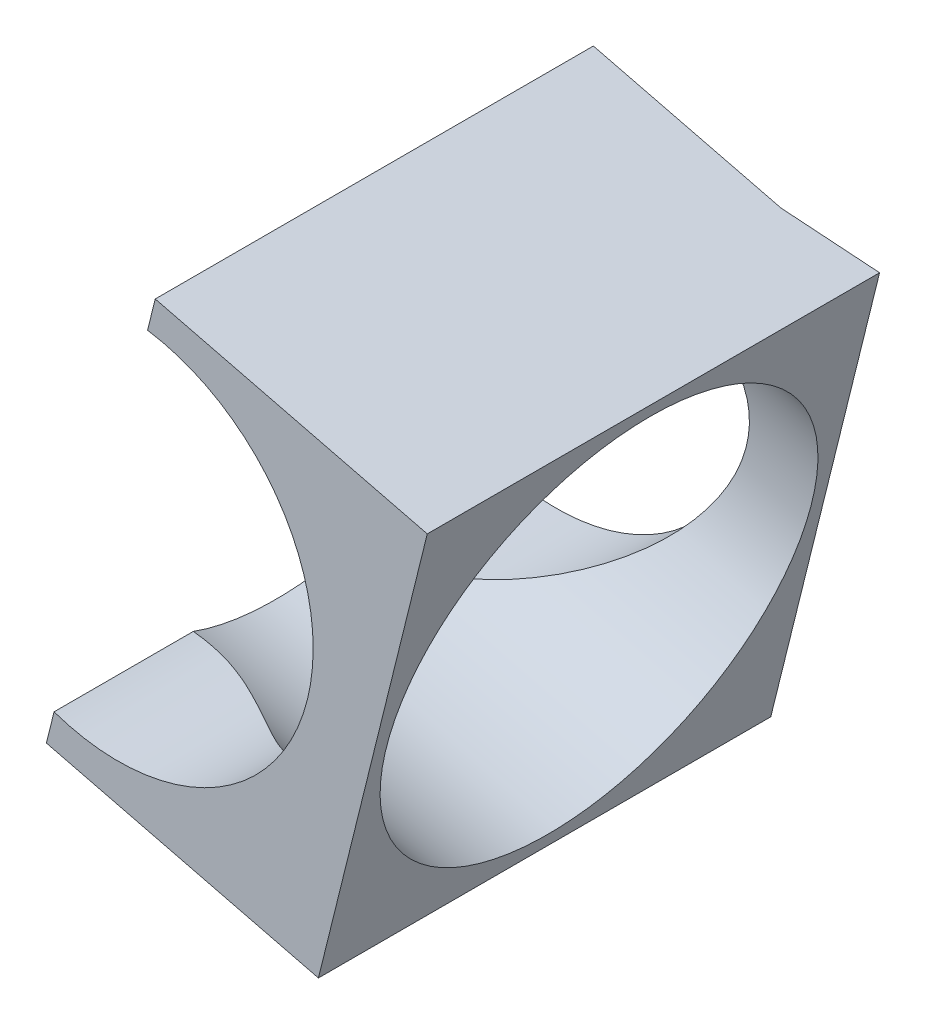
ISO-10303-21;
HEADER;
FILE_DESCRIPTION(('STEP AP214'),'2;1');
FILE_NAME('part.step','',(''),(''),'','','');
FILE_SCHEMA(('AUTOMOTIVE_DESIGN { 1 0 10303 214 1 1 1 1 }'));
ENDSEC;
DATA;
#1=APPLICATION_CONTEXT('core data for automotive mechanical design processes');
#2=APPLICATION_PROTOCOL_DEFINITION('international standard','automotive_design',2000,#1);
#3=PRODUCT_CONTEXT('',#1,'mechanical');
#4=PRODUCT('Part','Part','',(#3));
#5=PRODUCT_RELATED_PRODUCT_CATEGORY('part','',(#4));
#6=PRODUCT_DEFINITION_FORMATION('','',#4);
#7=PRODUCT_DEFINITION_CONTEXT('part definition',#1,'design');
#8=PRODUCT_DEFINITION('design','',#6,#7);
#9=PRODUCT_DEFINITION_SHAPE('','',#8);
#10=(LENGTH_UNIT() NAMED_UNIT(*) SI_UNIT(.MILLI.,.METRE.));
#11=(NAMED_UNIT(*) PLANE_ANGLE_UNIT() SI_UNIT($,.RADIAN.));
#12=(NAMED_UNIT(*) SI_UNIT($,.STERADIAN.) SOLID_ANGLE_UNIT());
#13=UNCERTAINTY_MEASURE_WITH_UNIT(LENGTH_MEASURE(1.E-05),#10,'distance_accuracy_value','');
#14=(GEOMETRIC_REPRESENTATION_CONTEXT(3) GLOBAL_UNCERTAINTY_ASSIGNED_CONTEXT((#13)) GLOBAL_UNIT_ASSIGNED_CONTEXT((#10,
#11,#12)) REPRESENTATION_CONTEXT('',''));
#15=CARTESIAN_POINT('',(0.,0.,0.));
#16=DIRECTION('',(0.,0.,1.));
#17=DIRECTION('',(1.,0.,0.));
#18=AXIS2_PLACEMENT_3D('',#15,#16,#17);
#19=CARTESIAN_POINT('',(0.,5.00000000000001,-61.2251126961954));
#20=DIRECTION('',(0.,0.,1.));
#21=DIRECTION('',(1.,0.,0.));
#22=AXIS2_PLACEMENT_3D('',#19,#20,#21);
#23=CYLINDRICAL_SURFACE('',#22,10.9999999999998);
#24=CARTESIAN_POINT('',(1.66526954813368,15.8732183520821,-17.6489794855667));
#25=CARTESIAN_POINT('',(1.79263034507844,15.8537329498391,-17.6227084909228));
#26=CARTESIAN_POINT('',(1.92065104835838,15.831816404451,-17.6011732618816));
#27=CARTESIAN_POINT('',(2.17708417707887,15.7831914838392,-17.5682368238232));
#28=CARTESIAN_POINT('',(2.30549662123175,15.7564828760743,-17.5568361067563));
#29=CARTESIAN_POINT('',(2.56016393760055,15.6987111197839,-17.5449091993817));
#30=CARTESIAN_POINT('',(2.68642565768366,15.6677068480607,-17.5442482859071));
#31=CARTESIAN_POINT('',(2.93737807330728,15.6013512316323,-17.5534656665461));
#32=CARTESIAN_POINT('',(3.06206905517549,15.5660006922239,-17.5633420108636));
#33=CARTESIAN_POINT('',(3.30907726053065,15.4912663344357,-17.5931538763105));
#34=CARTESIAN_POINT('',(3.43139314938191,15.4518803222101,-17.6130948923757));
#35=CARTESIAN_POINT('',(3.6729450007824,15.3694640019921,-17.6621380529273));
#36=CARTESIAN_POINT('',(3.79217954373631,15.3264320520208,-17.6912443412735));
#37=CARTESIAN_POINT('',(4.14510672729077,15.192226780014,-17.7907782567144));
#38=CARTESIAN_POINT('',(4.3735288305996,15.0960952325891,-17.8733534324487));
#39=CARTESIAN_POINT('',(4.80936274666048,14.8957664646193,-18.0588683653448));
#40=CARTESIAN_POINT('',(5.01717031261559,14.7918495930854,-18.1612121645229));
#41=CARTESIAN_POINT('',(5.41990509125868,14.5748087913997,-18.380748828761));
#42=CARTESIAN_POINT('',(5.61481946625253,14.4616759277185,-18.4979561645577));
#43=CARTESIAN_POINT('',(5.99375273620403,14.2263162744841,-18.7426991621253));
#44=CARTESIAN_POINT('',(6.177718646795,14.1040508482954,-18.8702789335522));
#45=CARTESIAN_POINT('',(6.53494198457993,13.8511227709247,-19.1317199952838));
#46=CARTESIAN_POINT('',(6.70820204127974,13.7204621979185,-19.2655797288188));
#47=CARTESIAN_POINT('',(7.16409222454299,13.3553362439337,-19.63301371519));
#48=CARTESIAN_POINT('',(7.43742802467754,13.1128004336115,-19.8701665071223));
#49=CARTESIAN_POINT('',(7.95805393830834,12.6027693933364,-20.3465525519393));
#50=CARTESIAN_POINT('',(8.20532754686847,12.3352585467338,-20.5857870205556));
#51=CARTESIAN_POINT('',(8.67332836385709,11.7754103012317,-21.0595657210039));
#52=CARTESIAN_POINT('',(8.89410965202035,11.4831256308439,-21.2941186638051));
#53=CARTESIAN_POINT('',(9.30828259897206,10.8729626037906,-21.7537090910718));
#54=CARTESIAN_POINT('',(9.50168972919099,10.5550988646424,-21.9787518996525));
#55=CARTESIAN_POINT('',(9.80757317649505,9.98833217247445,-22.3520435029962));
#56=CARTESIAN_POINT('',(9.92737663117616,9.74570316883091,-22.5038492787106));
#57=CARTESIAN_POINT('',(10.1504878738811,9.24759194079627,-22.7981622487658));
#58=CARTESIAN_POINT('',(10.2538000678474,8.99211317352387,-22.940671920694));
#59=CARTESIAN_POINT('',(10.4423738106766,8.46901186781502,-23.2142495046536));
#60=CARTESIAN_POINT('',(10.5276544504638,8.20140254099876,-23.3453294306305));
#61=CARTESIAN_POINT('',(10.6786350444003,7.65464440871634,-23.5940520641606));
#62=CARTESIAN_POINT('',(10.7443387764391,7.37549784152531,-23.7116973615798));
#63=CARTESIAN_POINT('',(10.8442327738177,6.85964631077585,-23.9109640754067));
#64=CARTESIAN_POINT('',(10.8820051459348,6.62465042698971,-23.9952226367863));
#65=CARTESIAN_POINT('',(10.9424613428414,6.14891451570834,-24.1520790523534));
#66=CARTESIAN_POINT('',(10.9651484842356,5.9081757628921,-24.2246794670106));
#67=CARTESIAN_POINT('',(10.9945840660808,5.42229270703315,-24.3570082929449));
#68=CARTESIAN_POINT('',(11.0013380949866,5.17714997906868,-24.4167412107466));
#69=CARTESIAN_POINT('',(10.9982234657201,4.68395748462285,-24.5222645975093));
#70=CARTESIAN_POINT('',(10.9883546432295,4.43590768942896,-24.5680549286414));
#71=CARTESIAN_POINT('',(10.9514166369292,3.93730462031128,-24.644988323737));
#72=CARTESIAN_POINT('',(10.9242472711376,3.68674518754038,-24.6760442251234));
#73=CARTESIAN_POINT('',(10.8524467841459,3.18665985586615,-24.7224274653022));
#74=CARTESIAN_POINT('',(10.8078156151219,2.93713395979534,-24.7377547610174));
#75=CARTESIAN_POINT('',(10.7012937094515,2.44137103623153,-24.7523282448863));
#76=CARTESIAN_POINT('',(10.6394066832929,2.19513331360478,-24.7515778875536));
#77=CARTESIAN_POINT('',(10.4989251052885,1.7080700523519,-24.7340205334872));
#78=CARTESIAN_POINT('',(10.4203315972898,1.46724417662413,-24.7172145397057));
#79=CARTESIAN_POINT('',(10.2554476711482,1.01526245137952,-24.6702488963766));
#80=CARTESIAN_POINT('',(10.1705698113829,0.80344181541088,-24.6414890153377));
#81=CARTESIAN_POINT('',(9.98864100804998,0.38711897757758,-24.5716116352797));
#82=CARTESIAN_POINT('',(9.89158604746593,0.182619219490634,-24.5304900520694));
#83=CARTESIAN_POINT('',(9.68630373491388,-0.217868676774017,-24.4365919698767));
#84=CARTESIAN_POINT('',(9.57807773241931,-0.413857838986258,-24.3838168777749));
#85=CARTESIAN_POINT('',(9.35145800837524,-0.796524698740172,-24.2674256527504));
#86=CARTESIAN_POINT('',(9.23306297634194,-0.983201191242198,-24.2038081215187));
#87=CARTESIAN_POINT('',(8.97957526915735,-1.35778696867727,-24.0624084581894));
#88=CARTESIAN_POINT('',(8.84390352307068,-1.54506636399004,-23.9839959229316));
#89=CARTESIAN_POINT('',(8.5634948126195,-1.9079066600099,-23.8171062111709));
#90=CARTESIAN_POINT('',(8.41875768409346,-2.08346734838844,-23.7286288523843));
#91=CARTESIAN_POINT('',(7.97252521491848,-2.59224466390264,-23.4497039891719));
#92=CARTESIAN_POINT('',(7.65892047907267,-2.90768529244566,-23.2457138048064));
#93=CARTESIAN_POINT('',(7.08219105157687,-3.42355722617735,-22.8603951049452));
#94=CARTESIAN_POINT('',(6.82393828220168,-3.63378803395723,-22.6845639609762));
#95=CARTESIAN_POINT('',(6.29544409361203,-4.02638767471842,-22.3201629095641));
#96=CARTESIAN_POINT('',(6.02520123489055,-4.20875315049812,-22.1315914711172));
#97=CARTESIAN_POINT('',(5.47369681993868,-4.5469218675267,-21.7443967360146));
#98=CARTESIAN_POINT('',(5.19239826420715,-4.70262454866932,-21.5457388962617));
#99=CARTESIAN_POINT('',(4.62098301844366,-4.98741221637405,-21.1423636824159));
#100=CARTESIAN_POINT('',(4.33086842692139,-5.11650348126767,-20.9376477506494));
#101=CARTESIAN_POINT('',(3.73472566966733,-5.35167325710376,-20.5203413428404));
#102=CARTESIAN_POINT('',(3.42848033884088,-5.45708057687033,-20.3076832192843));
#103=CARTESIAN_POINT('',(2.80661318465616,-5.64087214031409,-19.8839626895562));
#104=CARTESIAN_POINT('',(2.49098532073969,-5.71923854681958,-19.6729014261544));
#105=CARTESIAN_POINT('',(1.85017943969593,-5.84819730132579,-19.2591758207347));
#106=CARTESIAN_POINT('',(1.52503970799235,-5.89888819280295,-19.0564840932531));
#107=CARTESIAN_POINT('',(1.02770129293588,-5.95315046737215,-18.7653483288099));
#108=CARTESIAN_POINT('',(0.860405435273944,-5.96760703646524,-18.6704988002259));
#109=CARTESIAN_POINT('',(0.522108791907318,-5.98891031942641,-18.4867874431919));
#110=CARTESIAN_POINT('',(0.351109224746315,-5.99575949853586,-18.397923683775));
#111=CARTESIAN_POINT('',(0.0411138878403112,-6.00077400150783,-18.2460599264523));
#112=CARTESIAN_POINT('',(-0.0971029308558752,-6.00045482324145,-18.1815355781009));
#113=CARTESIAN_POINT('',(-0.376220448068109,-5.9944528824538,-18.0589681217852));
#114=CARTESIAN_POINT('',(-0.517121136665677,-5.9887701397503,-18.0009249898743));
#115=CARTESIAN_POINT('',(-0.943409690679376,-5.96314726941824,-17.8391977030742));
#116=CARTESIAN_POINT('',(-1.23329507349547,-5.93465207229777,-17.7474476432771));
#117=CARTESIAN_POINT('',(-1.6510797490269,-5.87611009558936,-17.6504407091418));
#118=CARTESIAN_POINT('',(-1.77608350487491,-5.85641555004186,-17.6258067427373));
#119=CARTESIAN_POINT('',(-2.0267604912457,-5.81241869587653,-17.5860016192614));
#120=CARTESIAN_POINT('',(-2.15243333166658,-5.78811883586772,-17.5708254518586));
#121=CARTESIAN_POINT('',(-2.40361034234116,-5.73494939427419,-17.5506441750705));
#122=CARTESIAN_POINT('',(-2.52911453808249,-5.70608060650178,-17.5456373009436));
#123=CARTESIAN_POINT('',(-2.77897859552945,-5.64395797167174,-17.5460372177706));
#124=CARTESIAN_POINT('',(-2.90333884290756,-5.6107056651307,-17.5514403593341));
#125=CARTESIAN_POINT('',(-3.12491992517803,-5.54728986051864,-17.5702539826098));
#126=CARTESIAN_POINT('',(-3.22251924549868,-5.51787232642863,-17.5818136748052));
#127=CARTESIAN_POINT('',(-3.41591746676108,-5.4566636148084,-17.6109700651386));
#128=CARTESIAN_POINT('',(-3.51171856328213,-5.42487560440735,-17.6285588172039));
#129=CARTESIAN_POINT('',(-3.60650706440077,-5.39197319061321,-17.6489794855666));
#130=B_SPLINE_CURVE_WITH_KNOTS('',3,(#24,#25,#26,#27,#28,#29,#30,#31,#32,#33,#34,#35,#36,#37,
#38,#39,#40,#41,#42,#43,#44,#45,#46,#47,#48,#49,#50,#51,#52,#53,#54,#55,#56,#57,#58,#59,#60,#61,
#62,#63,#64,#65,#66,#67,#68,#69,#70,#71,#72,#73,#74,#75,#76,#77,#78,#79,#80,#81,#82,#83,#84,#85,
#86,#87,#88,#89,#90,#91,#92,#93,#94,#95,#96,#97,#98,#99,#100,#101,#102,#103,#104,#105,#106,#107,
#108,#109,#110,#111,#112,#113,#114,#115,#116,#117,#118,#119,#120,#121,#122,#123,#124,#125,#126,
#127,#128,#129),.UNSPECIFIED.,.F.,.F.,(4,2,2,2,2,2,2,2,2,2,2,2,2,2,2,2,2,2,2,2,2,2,2,2,2,2,2,2,
2,2,2,2,2,2,2,2,2,2,2,2,2,2,2,2,2,2,2,2,2,2,2,2,4),(0.,0.394454745627189,0.788928637860081,
1.17845026222254,1.56789982267181,1.95756223844798,2.34740108439461,3.12862609057806,
3.88920206795538,4.65052428951634,5.41527292391775,6.1798329726683,7.48502208904681,
8.79103286458402,10.094330565331,11.3968886965074,12.3269526947469,13.2567677919413,
14.1855934617197,15.114239773403,15.8709799580788,16.6275537125099,17.3838620632257,
18.1401778901553,18.9009136318101,19.6616514569542,20.4222258283478,21.1827526918261,
21.8719730495565,22.561421370006,23.2507865016411,23.9402406055032,24.6720850038545,
25.4039426587287,26.867170623551,27.9955377360918,29.1240406867435,30.2567103346305,
31.3891124494129,32.5504070535588,33.7124662320671,34.8703602543341,35.4487133097982,
36.0268788901563,36.4842325834719,36.941584586924,37.8532332877706,38.2396530168455,
38.6258678631202,39.0120156813665,39.3980281542088,39.705580156405,40.0127283653593),.UNSPECIFIED.);
#131=CARTESIAN_POINT('',(1.66526954813368,15.8732183520821,-17.6489794855667));
#132=VERTEX_POINT('',#131);
#133=CARTESIAN_POINT('',(-3.60650706440076,-5.39197319061321,-17.6489794855666));
#134=VERTEX_POINT('',#133);
#135=EDGE_CURVE('E50',#132,#134,#130,.T.);
#136=ORIENTED_EDGE('',*,*,#135,.F.);
#137=DIRECTION('',(0.,0.,1.));
#138=VECTOR('',#137,1.);
#139=CARTESIAN_POINT('',(1.66526954813368,15.8732183520821,-61.2251126961954));
#140=LINE('',#139,#138);
#141=CARTESIAN_POINT('',(1.66526954813368,15.8732183520821,-24.7));
#142=VERTEX_POINT('',#141);
#143=EDGE_CURVE('E111',#142,#132,#140,.T.);
#144=ORIENTED_EDGE('',*,*,#143,.F.);
#145=CARTESIAN_POINT('',(0.,5.00000000000001,-24.7));
#146=DIRECTION('',(0.,0.,1.));
#147=DIRECTION('',(1.,0.,0.));
#148=AXIS2_PLACEMENT_3D('',#145,#146,#147);
#149=CIRCLE('',#148,10.9999999999998);
#150=CARTESIAN_POINT('',(10.7628601697729,7.27174843807865,-24.7));
#151=VERTEX_POINT('',#150);
#152=EDGE_CURVE('E83',#151,#142,#149,.T.);
#153=ORIENTED_EDGE('',*,*,#152,.F.);
#154=CARTESIAN_POINT('',(0.,5.00000000000001,-23.0836734693878));
#155=DIRECTION('',(0.1563976436081,-0.0387719733524759,0.986932880775683));
#156=DIRECTION('',(-0.957935567099651,0.237478336783925,0.161131898902146));
#157=AXIS2_PLACEMENT_3D('',#154,#155,#156);
#158=ELLIPSE('',#157,11.1456414253362,10.9999999999998);
#159=CARTESIAN_POINT('',(8.45539124127117,-2.03607553662062,-24.7));
#160=VERTEX_POINT('',#159);
#161=EDGE_CURVE('E152',#160,#151,#158,.T.);
#162=ORIENTED_EDGE('',*,*,#161,.F.);
#163=CARTESIAN_POINT('',(-3.60650706440077,-5.39197319061321,-24.7));
#164=VERTEX_POINT('',#163);
#165=EDGE_CURVE('E149',#164,#160,#149,.T.);
#166=ORIENTED_EDGE('',*,*,#165,.F.);
#167=DIRECTION('',(0.,0.,1.));
#168=VECTOR('',#167,1.);
#169=CARTESIAN_POINT('',(-3.60650706440076,-5.39197319061321,-61.2251126961954));
#170=LINE('',#169,#168);
#171=EDGE_CURVE('E139',#164,#134,#170,.T.);
#172=ORIENTED_EDGE('',*,*,#171,.T.);
#173=EDGE_LOOP('',(#136,#144,#153,#162,#166,#172));
#174=FACE_BOUND('',#173,.T.);
#175=ADVANCED_FACE('F35',(#174),#23,.F.);
#176=CARTESIAN_POINT('',(0.,5.00000000000001,0.));
#177=DIRECTION('',(0.,0.,1.));
#178=DIRECTION('',(1.,0.,0.));
#179=AXIS2_PLACEMENT_3D('',#176,#177,#178);
#180=PLANE('',#179);
#181=DIRECTION('',(0.240622580734445,0.97061875813354,0.));
#182=VECTOR('',#181,1.);
#183=CARTESIAN_POINT('',(17.4330955247405,13.8141749713329,0.));
#184=LINE('',#183,#182);
#185=CARTESIAN_POINT('',(11.2972197160122,-10.9366033610724,0.));
#186=VERTEX_POINT('',#185);
#187=CARTESIAN_POINT('',(17.4330955247405,13.8141749713329,0.));
#188=VERTEX_POINT('',#187);
#189=EDGE_CURVE('E128',#186,#188,#184,.T.);
#190=ORIENTED_EDGE('',*,*,#189,.T.);
#191=DIRECTION('',(-0.97061875813354,0.240622580734444,0.));
#192=VECTOR('',#191,1.);
#193=CARTESIAN_POINT('',(17.4330955247405,13.8141749713329,0.));
#194=LINE('',#193,#192);
#195=CARTESIAN_POINT('',(2.09731914623063,17.6160117469371,0.));
#196=VERTEX_POINT('',#195);
#197=EDGE_CURVE('E126',#188,#196,#194,.T.);
#198=ORIENTED_EDGE('',*,*,#197,.T.);
#199=DIRECTION('',(-0.240622580734444,-0.97061875813354,0.));
#200=VECTOR('',#199,1.);
#201=CARTESIAN_POINT('',(2.09731914623063,17.6160117469371,0.));
#202=LINE('',#201,#200);
#203=CARTESIAN_POINT('',(1.66526954813368,15.8732183520821,0.));
#204=VERTEX_POINT('',#203);
#205=EDGE_CURVE('E104',#196,#204,#202,.T.);
#206=ORIENTED_EDGE('',*,*,#205,.T.);
#207=CARTESIAN_POINT('',(0.,5.00000000000001,0.));
#208=DIRECTION('',(0.,0.,-1.));
#209=DIRECTION('',(1.,0.,0.));
#210=AXIS2_PLACEMENT_3D('',#207,#208,#209);
#211=CIRCLE('',#210,10.9999999999998);
#212=CARTESIAN_POINT('',(-3.60650706440076,-5.39197319061321,0.));
#213=VERTEX_POINT('',#212);
#214=EDGE_CURVE('E115',#204,#213,#211,.T.);
#215=ORIENTED_EDGE('',*,*,#214,.T.);
#216=DIRECTION('',(-0.240622580734444,-0.97061875813354,0.));
#217=VECTOR('',#216,1.);
#218=CARTESIAN_POINT('',(-4.0385566624977,-7.13476658546817,0.));
#219=LINE('',#218,#217);
#220=CARTESIAN_POINT('',(-4.0385566624977,-7.13476658546817,0.));
#221=VERTEX_POINT('',#220);
#222=EDGE_CURVE('E122',#213,#221,#219,.T.);
#223=ORIENTED_EDGE('',*,*,#222,.T.);
#224=DIRECTION('',(0.97061875813354,-0.240622580734444,0.));
#225=VECTOR('',#224,1.);
#226=CARTESIAN_POINT('',(11.2972197160122,-10.9366033610724,0.));
#227=LINE('',#226,#225);
#228=EDGE_CURVE('E142',#221,#186,#227,.T.);
#229=ORIENTED_EDGE('',*,*,#228,.T.);
#230=EDGE_LOOP('',(#190,#198,#206,#215,#223,#229));
#231=FACE_BOUND('',#230,.T.);
#232=ADVANCED_FACE('F125',(#231),#180,.T.);
#233=CARTESIAN_POINT('',(17.4330955247405,13.8141749713329,-61.2251126961954));
#234=DIRECTION('',(0.240622580734444,0.97061875813354,0.));
#235=DIRECTION('',(-0.97061875813354,0.240622580734444,0.));
#236=AXIS2_PLACEMENT_3D('',#233,#234,#235);
#237=PLANE('',#236);
#238=DIRECTION('',(0.957935567099651,-0.237478336783924,-0.161131898902146));
#239=VECTOR('',#238,1.);
#240=CARTESIAN_POINT('',(12.6770636098862,14.9932256169317,-24.7));
#241=LINE('',#240,#239);
#242=CARTESIAN_POINT('',(12.6770636098862,14.9932256169317,-24.7));
#243=VERTEX_POINT('',#242);
#244=CARTESIAN_POINT('',(17.4330955247405,13.8141749713329,-25.5));
#245=VERTEX_POINT('',#244);
#246=EDGE_CURVE('E73',#243,#245,#241,.T.);
#247=ORIENTED_EDGE('',*,*,#246,.F.);
#248=DIRECTION('',(0.97061875813354,-0.240622580734444,0.));
#249=VECTOR('',#248,1.);
#250=CARTESIAN_POINT('',(2.09731914623063,17.6160117469371,-24.7));
#251=LINE('',#250,#249);
#252=CARTESIAN_POINT('',(2.09731914623063,17.6160117469371,-24.7));
#253=VERTEX_POINT('',#252);
#254=EDGE_CURVE('E165',#253,#243,#251,.T.);
#255=ORIENTED_EDGE('',*,*,#254,.F.);
#256=DIRECTION('',(0.,0.,1.));
#257=VECTOR('',#256,1.);
#258=CARTESIAN_POINT('',(2.09731914623063,17.6160117469371,-61.2251126961954));
#259=LINE('',#258,#257);
#260=EDGE_CURVE('E112',#253,#196,#259,.T.);
#261=ORIENTED_EDGE('',*,*,#260,.T.);
#262=ORIENTED_EDGE('',*,*,#197,.F.);
#263=DIRECTION('',(0.,0.,1.));
#264=VECTOR('',#263,1.);
#265=CARTESIAN_POINT('',(17.4330955247405,13.8141749713329,-61.2251126961954));
#266=LINE('',#265,#264);
#267=EDGE_CURVE('E43',#245,#188,#266,.T.);
#268=ORIENTED_EDGE('',*,*,#267,.F.);
#269=EDGE_LOOP('',(#247,#255,#261,#262,#268));
#270=FACE_BOUND('',#269,.T.);
#271=ADVANCED_FACE('F37',(#270),#237,.T.);
#272=CARTESIAN_POINT('',(2.09731914623063,17.6160117469371,-61.2251126961954));
#273=DIRECTION('',(-0.97061875813354,0.240622580734444,0.));
#274=DIRECTION('',(-0.240622580734444,-0.97061875813354,0.));
#275=AXIS2_PLACEMENT_3D('',#272,#273,#274);
#276=PLANE('',#275);
#277=CARTESIAN_POINT('',(-0.97061875813353,5.24062258073447,-12.75));
#278=DIRECTION('',(-0.97061875813354,0.240622580734444,0.));
#279=DIRECTION('',(-0.240622580734444,-0.97061875813354,0.));
#280=AXIS2_PLACEMENT_3D('',#277,#278,#279);
#281=CIRCLE('',#280,12.);
#282=CARTESIAN_POINT('',(1.66526954813368,15.8732183520821,-7.85102051443324));
#283=VERTEX_POINT('',#282);
#284=EDGE_CURVE('E108',#283,#132,#281,.T.);
#285=ORIENTED_EDGE('',*,*,#284,.F.);
#286=EDGE_CURVE('E99',#283,#204,#140,.T.);
#287=ORIENTED_EDGE('',*,*,#286,.T.);
#288=ORIENTED_EDGE('',*,*,#205,.F.);
#289=ORIENTED_EDGE('',*,*,#260,.F.);
#290=DIRECTION('',(0.240622580734444,0.97061875813354,0.));
#291=VECTOR('',#290,1.);
#292=CARTESIAN_POINT('',(-4.92648625043272,-10.7164799530205,-24.7));
#293=LINE('',#292,#291);
#294=EDGE_CURVE('E159',#142,#253,#293,.T.);
#295=ORIENTED_EDGE('',*,*,#294,.F.);
#296=ORIENTED_EDGE('',*,*,#143,.T.);
#297=EDGE_LOOP('',(#285,#287,#288,#289,#295,#296));
#298=FACE_BOUND('',#297,.T.);
#299=ADVANCED_FACE('F101',(#298),#276,.T.);
#300=CARTESIAN_POINT('',(-3.60650706440077,-5.39197319061321,-7.85102051443335));
#301=CARTESIAN_POINT('',(-3.4847927105438,-5.4342351068518,-7.87729150907729));
#302=CARTESIAN_POINT('',(-3.36135926595303,-5.47465564849205,-7.89882673811853));
#303=CARTESIAN_POINT('',(-3.11190772497153,-5.55144276402479,-7.93176317617689));
#304=CARTESIAN_POINT('',(-2.98588950341411,-5.5878091410448,-7.94316389324379));
#305=CARTESIAN_POINT('',(-2.73372675845242,-5.65568378951346,-7.95509080061842));
#306=CARTESIAN_POINT('',(-2.60760368183629,-5.6872473185987,-7.95575171409302));
#307=CARTESIAN_POINT('',(-2.35471608888465,-5.74579685378082,-7.94653433345402));
#308=CARTESIAN_POINT('',(-2.22795169553631,-5.77278370566748,-7.93665798913648));
#309=CARTESIAN_POINT('',(-1.97463782255609,-5.82208238214606,-7.90684612368965));
#310=CARTESIAN_POINT('',(-1.84808849825347,-5.84439164352022,-7.88690510762442));
#311=CARTESIAN_POINT('',(-1.59601085435858,-5.88434922354808,-7.83786194707287));
#312=CARTESIAN_POINT('',(-1.47048302299721,-5.90199542726066,-7.80875565872657));
#313=CARTESIAN_POINT('',(-1.09573622966902,-5.94818517521772,-7.70922174328572));
#314=CARTESIAN_POINT('',(-0.84886147017941,-5.96988275151744,-7.62664656755143));
#315=CARTESIAN_POINT('',(-0.369921761690579,-5.99633219948712,-7.44113163465538));
#316=CARTESIAN_POINT('',(-0.137637839684543,-6.00151681471625,-7.33878783547724));
#317=CARTESIAN_POINT('',(0.319841844504047,-5.99772866480258,-7.11925117123911));
#318=CARTESIAN_POINT('',(0.545030428479012,-5.98874200406073,-7.00204383544243));
#319=CARTESIAN_POINT('',(0.990021619650453,-5.95763847971765,-6.75730083787488));
#320=CARTESIAN_POINT('',(1.209795425376,-5.93546270425014,-6.62972106644794));
#321=CARTESIAN_POINT('',(1.64379696989754,-5.87868432162469,-6.36828000471637));
#322=CARTESIAN_POINT('',(1.85802606297914,-5.84408478024981,-6.23442027118132));
#323=CARTESIAN_POINT('',(2.43167723927884,-5.73418869570137,-5.86698628481018));
#324=CARTESIAN_POINT('',(2.7866510072749,-5.64741483466852,-5.62983349287783));
#325=CARTESIAN_POINT('',(3.48522759104894,-5.43963186955695,-5.15344744806086));
#326=CARTESIAN_POINT('',(3.82882310776115,-5.31860124766454,-4.91421297944451));
#327=CARTESIAN_POINT('',(4.50413839424886,-5.04218835626866,-4.44043427899623));
#328=CARTESIAN_POINT('',(4.83588135162745,-4.88687797034271,-4.20588133619503));
#329=CARTESIAN_POINT('',(5.48710426741012,-4.54083337274155,-3.74629090892831));
#330=CARTESIAN_POINT('',(5.80659107775311,-4.35011931268917,-3.52124810034756));
#331=CARTESIAN_POINT('',(6.34179358017391,-3.99186319189264,-3.14795649700384));
#332=CARTESIAN_POINT('',(6.56105734188277,-3.83329111375823,-2.9961507212895));
#333=CARTESIAN_POINT('',(6.99100318246346,-3.49707690185922,-2.70183775123429));
#334=CARTESIAN_POINT('',(7.20168754223707,-3.31943988292468,-2.55932807930607));
#335=CARTESIAN_POINT('',(7.61276827673923,-2.94499674673431,-2.2857504953465));
#336=CARTESIAN_POINT('',(7.81317536047113,-2.74821122869082,-2.1546705693696));
#337=CARTESIAN_POINT('',(8.20206641027602,-2.33529072018583,-1.90594793583947));
#338=CARTESIAN_POINT('',(8.39055267125404,-2.11915947348397,-1.78830263842024));
#339=CARTESIAN_POINT('',(8.71983622727183,-1.70970379551002,-1.5890359245933));
#340=CARTESIAN_POINT('',(8.86300250596676,-1.51956375728443,-1.50477736321374));
#341=CARTESIAN_POINT('',(9.13867686804776,-1.12715675541219,-1.34792094764662));
#342=CARTESIAN_POINT('',(9.27118728857115,-0.924892468043229,-1.27532053298946));
#343=CARTESIAN_POINT('',(9.52417296268046,-0.509023442814317,-1.14299170705515));
#344=CARTESIAN_POINT('',(9.64465242185893,-0.295422708039386,-1.08325878925342));
#345=CARTESIAN_POINT('',(9.87227142849671,0.142113719370268,-0.977735402490713));
#346=CARTESIAN_POINT('',(9.97941084407736,0.366049514146624,-0.931945071358632));
#347=CARTESIAN_POINT('',(10.1796504780331,0.824169068232974,-0.855011676263038));
#348=CARTESIAN_POINT('',(10.2726649921767,1.05840506876797,-0.823955774876656));
#349=CARTESIAN_POINT('',(10.4427715398756,1.53411970099818,-0.777572534697789));
#350=CARTESIAN_POINT('',(10.5198635298221,1.77559835252763,-0.76224523898264));
#351=CARTESIAN_POINT('',(10.6572503244499,2.26370967326306,-0.747671755113659));
#352=CARTESIAN_POINT('',(10.7175487346513,2.51034122391778,-0.748422112446381));
#353=CARTESIAN_POINT('',(10.8208446736381,3.00662304225261,-0.765979466512782));
#354=CARTESIAN_POINT('',(10.8638432828568,3.25627312041171,-0.782785460294323));
#355=CARTESIAN_POINT('',(10.9291758466046,3.73293426333099,-0.829751103623404));
#356=CARTESIAN_POINT('',(10.9530693128984,3.95987331939884,-0.858510984662257));
#357=CARTESIAN_POINT('',(10.9866743045389,4.41296657615793,-0.928388364720258));
#358=CARTESIAN_POINT('',(10.9963811365312,4.63912049242795,-0.96950994793059));
#359=CARTESIAN_POINT('',(11.0019403296044,5.08912102384273,-1.06340803012323));
#360=CARTESIAN_POINT('',(10.9977943622241,5.31296791409384,-1.11618312222506));
#361=CARTESIAN_POINT('',(10.976162677428,5.75717788144331,-1.23257434724953));
#362=CARTESIAN_POINT('',(10.9586752383997,5.97754050517804,-1.29619187848125));
#363=CARTESIAN_POINT('',(10.9095121226869,6.42715535191217,-1.43759154181052));
#364=CARTESIAN_POINT('',(10.8770302056284,6.65612111280039,-1.51600407706838));
#365=CARTESIAN_POINT('',(10.7985771172526,7.1079255375651,-1.6828937888291));
#366=CARTESIAN_POINT('',(10.7526057016036,7.33076409038112,-1.77137114761568));
#367=CARTESIAN_POINT('',(10.595698985466,7.98906345674777,-2.05029601082804));
#368=CARTESIAN_POINT('',(10.4657532708575,8.41446307091712,-2.25428619519349));
#369=CARTESIAN_POINT('',(10.1967748780214,9.13999136722197,-2.63960489505471));
#370=CARTESIAN_POINT('',(10.0666273633586,9.44650908262655,-2.81543603902369));
#371=CARTESIAN_POINT('',(9.78271746736979,10.0405088774569,-3.17983709043584));
#372=CARTESIAN_POINT('',(9.62895224506177,10.3279886608415,-3.36840852888272));
#373=CARTESIAN_POINT('',(9.29927168306663,10.884608753841,-3.75560326398528));
#374=CARTESIAN_POINT('',(9.12327665617648,11.1536774307277,-3.95426110373823));
#375=CARTESIAN_POINT('',(8.75105632071215,11.6723983775136,-4.35763631758403));
#376=CARTESIAN_POINT('',(8.55483580028719,11.9220552184976,-4.5623522493505));
#377=CARTESIAN_POINT('',(8.13757456669405,12.4084543071415,-4.97965865715947));
#378=CARTESIAN_POINT('',(7.916028318669,12.6447045255528,-5.19231678071559));
#379=CARTESIAN_POINT('',(7.45202248375751,13.0976909286766,-5.61603731044362));
#380=CARTESIAN_POINT('',(7.20954922395772,13.3144141633126,-5.82709857384546));
#381=CARTESIAN_POINT('',(6.70318502637826,13.7277636969446,-6.24082417926515));
#382=CARTESIAN_POINT('',(6.43937397083727,13.9244592448997,-6.44351590674678));
#383=CARTESIAN_POINT('',(6.02497278600996,14.2047475813428,-6.73465167118993));
#384=CARTESIAN_POINT('',(5.88380227391676,14.2956749308925,-6.82950119977397));
#385=CARTESIAN_POINT('',(5.5946307407763,14.4725315767932,-7.01321255680795));
#386=CARTESIAN_POINT('',(5.44663194869527,14.5584624837259,-7.10207631622486));
#387=CARTESIAN_POINT('',(5.17487589447703,14.70769686696,-7.25394007354753));
#388=CARTESIAN_POINT('',(5.05251527957599,14.7719764964417,-7.3184644218989));
#389=CARTESIAN_POINT('',(4.80291559894494,14.8970469211504,-7.44103187821468));
#390=CARTESIAN_POINT('',(4.67567655124186,14.9578377292674,-7.49907501012555));
#391=CARTESIAN_POINT('',(4.2867829664617,15.1343037103629,-7.66080229692566));
#392=CARTESIAN_POINT('',(4.01715559683526,15.2445152931376,-7.75255235672277));
#393=CARTESIAN_POINT('',(3.62040445625765,15.3879019403409,-7.8495592908581));
#394=CARTESIAN_POINT('',(3.50067650978069,15.4288779446952,-7.87419325726252));
#395=CARTESIAN_POINT('',(3.2584763544375,15.5070684775244,-7.91399838073843));
#396=CARTESIAN_POINT('',(3.13600563425889,15.5442849888444,-7.92917454814124));
#397=CARTESIAN_POINT('',(2.88907878987283,15.61459866982,-7.94935582492936));
#398=CARTESIAN_POINT('',(2.76462301392334,15.647696553271,-7.95436269905631));
#399=CARTESIAN_POINT('',(2.51467499828426,15.7094805191536,-7.95396278222926));
#400=CARTESIAN_POINT('',(2.38918313716637,15.738168143862,-7.94855964066578));
#401=CARTESIAN_POINT('',(2.16363892511773,15.7855975514706,-7.92974601739011));
#402=CARTESIAN_POINT('',(2.0636003607244,15.8051757095329,-7.91818632519469));
#403=CARTESIAN_POINT('',(1.86400642344014,15.841392260515,-7.88902993486127));
#404=CARTESIAN_POINT('',(1.76445058859831,15.8580344793827,-7.87144118279601));
#405=CARTESIAN_POINT('',(1.66526954813368,15.8732183520821,-7.85102051443324));
#406=B_SPLINE_CURVE_WITH_KNOTS('',3,(#300,#301,#302,#303,#304,#305,#306,#307,#308,#309,#310,
#311,#312,#313,#314,#315,#316,#317,#318,#319,#320,#321,#322,#323,#324,#325,#326,#327,#328,#329,
#330,#331,#332,#333,#334,#335,#336,#337,#338,#339,#340,#341,#342,#343,#344,#345,#346,#347,#348,
#349,#350,#351,#352,#353,#354,#355,#356,#357,#358,#359,#360,#361,#362,#363,#364,#365,#366,#367,
#368,#369,#370,#371,#372,#373,#374,#375,#376,#377,#378,#379,#380,#381,#382,#383,#384,#385,#386,
#387,#388,#389,#390,#391,#392,#393,#394,#395,#396,#397,#398,#399,#400,#401,#402,#403,#404,#405),
.UNSPECIFIED.,.F.,.F.,(4,2,2,2,2,2,2,2,2,2,2,2,2,2,2,2,2,2,2,2,2,2,2,2,2,2,2,2,2,2,2,2,2,2,2,2,
2,2,2,2,2,2,2,2,2,2,2,2,2,2,2,2,4),(0.,0.394454745627184,0.788928637860066,1.17845026222252,
1.56789982267178,1.95756223844794,2.34740108439456,3.12862609057799,3.88920206795531,
4.65052428951625,5.41527292391764,6.17983297266818,7.4850220890467,8.79103286458392,
10.0943305653309,11.3968886965074,12.3269526947468,13.2567677919412,14.1855934617197,
15.114239773403,15.8709799580788,16.6275537125099,17.3838620632256,18.1401778901553,
18.9009136318101,19.6616514569541,20.4222258283478,21.1827526918261,21.8719730495565,
22.561421370006,23.2507865016411,23.9402406055032,24.6720850038545,25.4039426587287,
26.8671706235509,27.9955377360918,29.1240406867435,30.2567103346304,31.3891124494128,
32.5504070535587,33.712466232067,34.870360254334,35.4487133097981,36.0268788901561,
36.4842325834718,36.941584586924,37.8532332877706,38.2396530168455,38.6258678631201,
39.0120156813665,39.3980281542087,39.705580156405,40.0127283653593),.UNSPECIFIED.);
#407=CARTESIAN_POINT('',(-3.60650706440076,-5.39197319061321,-7.85102051443336));
#408=VERTEX_POINT('',#407);
#409=EDGE_CURVE('E176',#408,#283,#406,.T.);
#410=ORIENTED_EDGE('',*,*,#409,.F.);
#411=EDGE_CURVE('E118',#408,#213,#170,.T.);
#412=ORIENTED_EDGE('',*,*,#411,.T.);
#413=ORIENTED_EDGE('',*,*,#214,.F.);
#414=ORIENTED_EDGE('',*,*,#286,.F.);
#415=EDGE_LOOP('',(#410,#412,#413,#414));
#416=FACE_BOUND('',#415,.T.);
#417=ADVANCED_FACE('F116',(#416),#23,.F.);
#418=CARTESIAN_POINT('',(-4.0385566624977,-7.13476658546817,-61.2251126961954));
#419=DIRECTION('',(-0.97061875813354,0.240622580734444,0.));
#420=DIRECTION('',(-0.240622580734444,-0.97061875813354,0.));
#421=AXIS2_PLACEMENT_3D('',#418,#419,#420);
#422=PLANE('',#421);
#423=CARTESIAN_POINT('',(-0.970618758133531,5.24062258073447,-12.75));
#424=DIRECTION('',(-0.97061875813354,0.240622580734444,0.));
#425=DIRECTION('',(-0.240622580734444,-0.97061875813354,0.));
#426=AXIS2_PLACEMENT_3D('',#423,#424,#425);
#427=CIRCLE('',#426,12.);
#428=EDGE_CURVE('E241',#134,#408,#427,.T.);
#429=ORIENTED_EDGE('',*,*,#428,.F.);
#430=ORIENTED_EDGE('',*,*,#171,.F.);
#431=CARTESIAN_POINT('',(-4.0385566624977,-7.13476658546817,-24.7));
#432=VERTEX_POINT('',#431);
#433=EDGE_CURVE('E161',#432,#164,#293,.T.);
#434=ORIENTED_EDGE('',*,*,#433,.F.);
#435=DIRECTION('',(0.,0.,1.));
#436=VECTOR('',#435,1.);
#437=CARTESIAN_POINT('',(-4.0385566624977,-7.13476658546817,-61.2251126961954));
#438=LINE('',#437,#436);
#439=EDGE_CURVE('E137',#432,#221,#438,.T.);
#440=ORIENTED_EDGE('',*,*,#439,.T.);
#441=ORIENTED_EDGE('',*,*,#222,.F.);
#442=ORIENTED_EDGE('',*,*,#411,.F.);
#443=EDGE_LOOP('',(#429,#430,#434,#440,#441,#442));
#444=FACE_BOUND('',#443,.T.);
#445=ADVANCED_FACE('F205',(#444),#422,.T.);
#446=CARTESIAN_POINT('',(11.2972197160122,-10.9366033610724,-61.2251126961954));
#447=DIRECTION('',(-0.240622580734444,-0.97061875813354,0.));
#448=DIRECTION('',(0.97061875813354,-0.240622580734444,0.));
#449=AXIS2_PLACEMENT_3D('',#446,#447,#448);
#450=PLANE('',#449);
#451=DIRECTION('',(-0.957935567099651,0.237478336783924,0.161131898902146));
#452=VECTOR('',#451,1.);
#453=CARTESIAN_POINT('',(16.8115329377523,-12.3036367789559,-26.4275485649316));
#454=LINE('',#453,#452);
#455=CARTESIAN_POINT('',(11.2972197160122,-10.9366033610724,-25.5));
#456=VERTEX_POINT('',#455);
#457=CARTESIAN_POINT('',(6.54118780115787,-9.75755271547361,-24.7));
#458=VERTEX_POINT('',#457);
#459=EDGE_CURVE('E155',#456,#458,#454,.T.);
#460=ORIENTED_EDGE('',*,*,#459,.F.);
#461=DIRECTION('',(0.,0.,1.));
#462=VECTOR('',#461,1.);
#463=CARTESIAN_POINT('',(11.2972197160122,-10.9366033610724,-61.2251126961954));
#464=LINE('',#463,#462);
#465=EDGE_CURVE('E135',#456,#186,#464,.T.);
#466=ORIENTED_EDGE('',*,*,#465,.T.);
#467=ORIENTED_EDGE('',*,*,#228,.F.);
#468=ORIENTED_EDGE('',*,*,#439,.F.);
#469=DIRECTION('',(-0.97061875813354,0.240622580734444,0.));
#470=VECTOR('',#469,1.);
#471=CARTESIAN_POINT('',(11.2972197160122,-10.9366033610724,-24.7));
#472=LINE('',#471,#470);
#473=EDGE_CURVE('E11',#458,#432,#472,.T.);
#474=ORIENTED_EDGE('',*,*,#473,.F.);
#475=EDGE_LOOP('',(#460,#466,#467,#468,#474));
#476=FACE_BOUND('',#475,.T.);
#477=ADVANCED_FACE('F202',(#476),#450,.T.);
#478=CARTESIAN_POINT('',(17.4330955247405,13.8141749713329,-61.2251126961954));
#479=DIRECTION('',(0.97061875813354,-0.240622580734445,0.));
#480=DIRECTION('',(0.240622580734445,0.97061875813354,0.));
#481=AXIS2_PLACEMENT_3D('',#478,#479,#480);
#482=PLANE('',#481);
#483=CARTESIAN_POINT('',(14.3651576203764,1.43878580513026,-12.75));
#484=DIRECTION('',(0.97061875813354,-0.240622580734444,0.));
#485=DIRECTION('',(0.240622580734444,0.97061875813354,0.));
#486=AXIS2_PLACEMENT_3D('',#483,#484,#485);
#487=CIRCLE('',#486,12.);
#488=CARTESIAN_POINT('',(17.2526285891897,13.0862109027327,-12.75));
#489=VERTEX_POINT('',#488);
#490=EDGE_CURVE('E244',#489,#489,#487,.T.);
#491=ORIENTED_EDGE('',*,*,#490,.F.);
#492=EDGE_LOOP('',(#491));
#493=FACE_BOUND('',#492,.T.);
#494=ORIENTED_EDGE('',*,*,#465,.F.);
#495=DIRECTION('',(0.240622580734445,0.97061875813354,0.));
#496=VECTOR('',#495,1.);
#497=CARTESIAN_POINT('',(17.4330955247405,13.8141749713329,-25.5));
#498=LINE('',#497,#496);
#499=EDGE_CURVE('E133',#456,#245,#498,.T.);
#500=ORIENTED_EDGE('',*,*,#499,.T.);
#501=ORIENTED_EDGE('',*,*,#267,.T.);
#502=ORIENTED_EDGE('',*,*,#189,.F.);
#503=EDGE_LOOP('',(#494,#500,#501,#502));
#504=FACE_BOUND('',#503,.T.);
#505=ADVANCED_FACE('F199',(#493,#504),#482,.T.);
#506=CARTESIAN_POINT('',(-4.92648625043272,-10.7164799530205,-24.7));
#507=DIRECTION('',(0.,0.,1.));
#508=DIRECTION('',(1.,0.,0.));
#509=AXIS2_PLACEMENT_3D('',#506,#507,#508);
#510=PLANE('',#509);
#511=ORIENTED_EDGE('',*,*,#152,.T.);
#512=ORIENTED_EDGE('',*,*,#294,.T.);
#513=ORIENTED_EDGE('',*,*,#254,.T.);
#514=DIRECTION('',(0.240622580734444,0.97061875813354,0.));
#515=VECTOR('',#514,1.);
#516=CARTESIAN_POINT('',(5.65325821322285,-13.339266083026,-24.7));
#517=LINE('',#516,#515);
#518=EDGE_CURVE('E162',#151,#243,#517,.T.);
#519=ORIENTED_EDGE('',*,*,#518,.F.);
#520=EDGE_LOOP('',(#511,#512,#513,#519));
#521=FACE_BOUND('',#520,.T.);
#522=ADVANCED_FACE('F193',(#521),#510,.F.);
#523=CARTESIAN_POINT('',(5.65325821322285,-13.339266083026,-24.7));
#524=DIRECTION('',(0.1563976436081,-0.0387719733524759,0.986932880775683));
#525=DIRECTION('',(0.987675529460832,0.,-0.156515329933734));
#526=AXIS2_PLACEMENT_3D('',#523,#524,#525);
#527=PLANE('',#526);
#528=ORIENTED_EDGE('',*,*,#161,.T.);
#529=ORIENTED_EDGE('',*,*,#518,.T.);
#530=ORIENTED_EDGE('',*,*,#246,.T.);
#531=ORIENTED_EDGE('',*,*,#499,.F.);
#532=ORIENTED_EDGE('',*,*,#459,.T.);
#533=EDGE_CURVE('E158',#458,#160,#517,.T.);
#534=ORIENTED_EDGE('',*,*,#533,.T.);
#535=EDGE_LOOP('',(#528,#529,#530,#531,#532,#534));
#536=FACE_BOUND('',#535,.T.);
#537=ADVANCED_FACE('F189',(#536),#527,.F.);
#538=ORIENTED_EDGE('',*,*,#165,.T.);
#539=ORIENTED_EDGE('',*,*,#533,.F.);
#540=ORIENTED_EDGE('',*,*,#473,.T.);
#541=ORIENTED_EDGE('',*,*,#433,.T.);
#542=EDGE_LOOP('',(#538,#539,#540,#541));
#543=FACE_BOUND('',#542,.T.);
#544=ADVANCED_FACE('F188',(#543),#510,.F.);
#545=CARTESIAN_POINT('',(-6.75123210449974,6.67367349797137,-12.75));
#546=DIRECTION('',(0.97061875813354,-0.240622580734444,0.));
#547=DIRECTION('',(0.240622580734444,0.97061875813354,0.));
#548=AXIS2_PLACEMENT_3D('',#545,#546,#547);
#549=CYLINDRICAL_SURFACE('',#548,12.);
#550=ORIENTED_EDGE('',*,*,#284,.T.);
#551=ORIENTED_EDGE('',*,*,#135,.T.);
#552=ORIENTED_EDGE('',*,*,#428,.T.);
#553=ORIENTED_EDGE('',*,*,#409,.T.);
#554=EDGE_LOOP('',(#550,#551,#552,#553));
#555=FACE_BOUND('',#554,.T.);
#556=ORIENTED_EDGE('',*,*,#490,.T.);
#557=EDGE_LOOP('',(#556));
#558=FACE_BOUND('',#557,.T.);
#559=ADVANCED_FACE('F184',(#555,#558),#549,.F.);
#560=CLOSED_SHELL('',(#175,#232,#271,#299,#417,#445,#477,#505,#522,#537,#544,#559));
#561=MANIFOLD_SOLID_BREP('B2',#560);
#562=ADVANCED_BREP_SHAPE_REPRESENTATION('',(#18,#561),#14);
#563=SHAPE_DEFINITION_REPRESENTATION(#9,#562);
ENDSEC;
END-ISO-10303-21;
